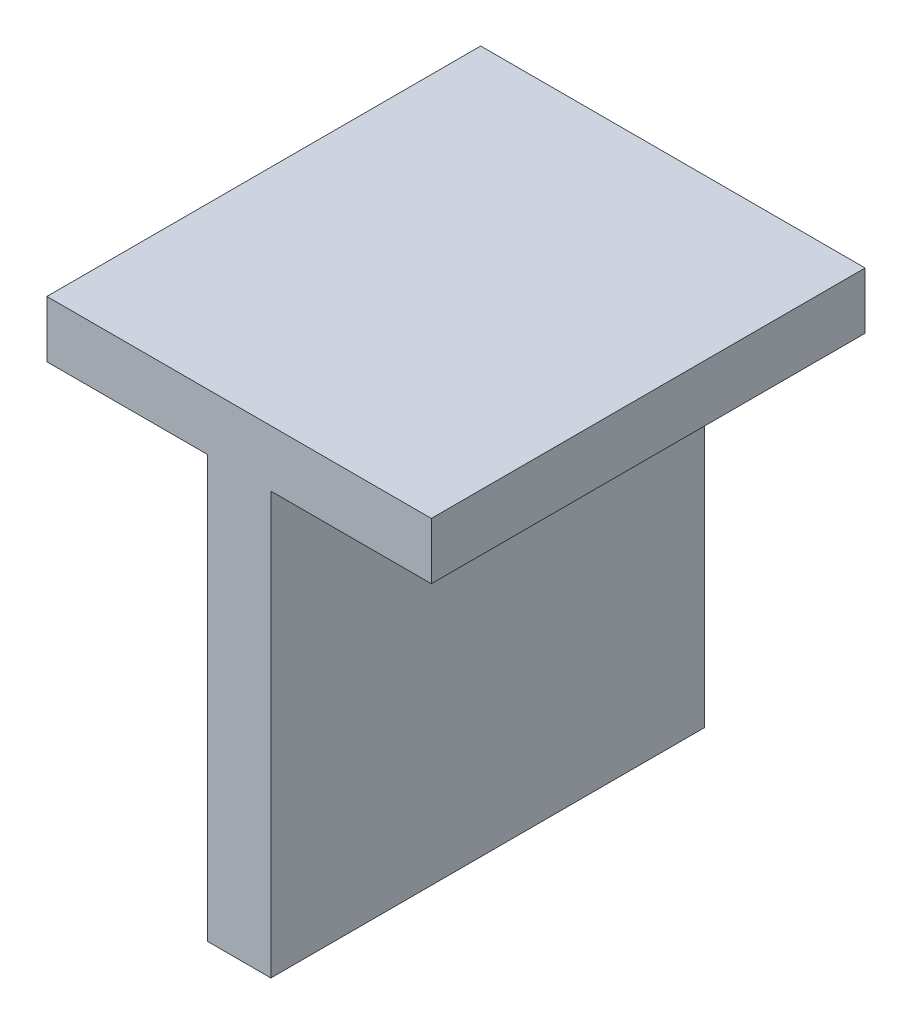
ISO-10303-21;
HEADER;
FILE_DESCRIPTION(('STEP AP214'),'2;1');
FILE_NAME('part.step','',(''),(''),'','','');
FILE_SCHEMA(('AUTOMOTIVE_DESIGN { 1 0 10303 214 1 1 1 1 }'));
ENDSEC;
DATA;
#1=APPLICATION_CONTEXT('core data for automotive mechanical design processes');
#2=APPLICATION_PROTOCOL_DEFINITION('international standard','automotive_design',2000,#1);
#3=PRODUCT_CONTEXT('',#1,'mechanical');
#4=PRODUCT('Part','Part','',(#3));
#5=PRODUCT_RELATED_PRODUCT_CATEGORY('part','',(#4));
#6=PRODUCT_DEFINITION_FORMATION('','',#4);
#7=PRODUCT_DEFINITION_CONTEXT('part definition',#1,'design');
#8=PRODUCT_DEFINITION('design','',#6,#7);
#9=PRODUCT_DEFINITION_SHAPE('','',#8);
#10=(LENGTH_UNIT() NAMED_UNIT(*) SI_UNIT(.MILLI.,.METRE.));
#11=(NAMED_UNIT(*) PLANE_ANGLE_UNIT() SI_UNIT($,.RADIAN.));
#12=(NAMED_UNIT(*) SI_UNIT($,.STERADIAN.) SOLID_ANGLE_UNIT());
#13=UNCERTAINTY_MEASURE_WITH_UNIT(LENGTH_MEASURE(1.E-05),#10,'distance_accuracy_value','');
#14=(GEOMETRIC_REPRESENTATION_CONTEXT(3) GLOBAL_UNCERTAINTY_ASSIGNED_CONTEXT((#13)) GLOBAL_UNIT_ASSIGNED_CONTEXT((#10,
#11,#12)) REPRESENTATION_CONTEXT('',''));
#15=CARTESIAN_POINT('',(0.,0.,0.));
#16=DIRECTION('',(0.,0.,1.));
#17=DIRECTION('',(1.,0.,0.));
#18=AXIS2_PLACEMENT_3D('',#15,#16,#17);
#19=CARTESIAN_POINT('',(-0.729443457161896,-0.704324120785311,0.));
#20=DIRECTION('',(0.,-1.,0.));
#21=DIRECTION('',(1.,0.,0.));
#22=AXIS2_PLACEMENT_3D('',#19,#20,#21);
#23=PLANE('',#22);
#24=DIRECTION('',(-1.,0.,0.));
#25=VECTOR('',#24,1.);
#26=CARTESIAN_POINT('',(-0.692455206347265,-0.704324120785311,0.));
#27=LINE('',#26,#25);
#28=CARTESIAN_POINT('',(-0.692455206347265,-0.704324120785311,0.));
#29=VERTEX_POINT('',#28);
#30=CARTESIAN_POINT('',(-0.729443457161896,-0.704324120785311,0.));
#31=VERTEX_POINT('',#30);
#32=EDGE_CURVE('E11',#29,#31,#27,.T.);
#33=ORIENTED_EDGE('',*,*,#32,.F.);
#34=DIRECTION('',(0.,0.,1.));
#35=VECTOR('',#34,1.);
#36=CARTESIAN_POINT('',(-0.692455206347265,-0.704324120785311,0.));
#37=LINE('',#36,#35);
#38=CARTESIAN_POINT('',(-0.692455206347265,-0.704324120785311,0.1));
#39=VERTEX_POINT('',#38);
#40=EDGE_CURVE('E145',#29,#39,#37,.T.);
#41=ORIENTED_EDGE('',*,*,#40,.T.);
#42=DIRECTION('',(1.,0.,0.));
#43=VECTOR('',#42,1.);
#44=CARTESIAN_POINT('',(-0.729443457161896,-0.704324120785311,0.1));
#45=LINE('',#44,#43);
#46=CARTESIAN_POINT('',(-0.729443457161896,-0.704324120785311,0.1));
#47=VERTEX_POINT('',#46);
#48=EDGE_CURVE('E103',#47,#39,#45,.T.);
#49=ORIENTED_EDGE('',*,*,#48,.F.);
#50=DIRECTION('',(0.,0.,1.));
#51=VECTOR('',#50,1.);
#52=CARTESIAN_POINT('',(-0.729443457161896,-0.704324120785311,0.));
#53=LINE('',#52,#51);
#54=EDGE_CURVE('E140',#31,#47,#53,.T.);
#55=ORIENTED_EDGE('',*,*,#54,.F.);
#56=EDGE_LOOP('',(#33,#41,#49,#55));
#57=FACE_BOUND('',#56,.T.);
#58=ADVANCED_FACE('F17',(#57),#23,.T.);
#59=CARTESIAN_POINT('',(-0.729443457161896,-0.691279955039089,0.));
#60=DIRECTION('',(-1.,0.,0.));
#61=DIRECTION('',(0.,-1.,0.));
#62=AXIS2_PLACEMENT_3D('',#59,#60,#61);
#63=PLANE('',#62);
#64=DIRECTION('',(0.,1.,0.));
#65=VECTOR('',#64,1.);
#66=CARTESIAN_POINT('',(-0.729443457161896,-0.704324120785311,0.));
#67=LINE('',#66,#65);
#68=CARTESIAN_POINT('',(-0.729443457161896,-0.691279955039089,0.));
#69=VERTEX_POINT('',#68);
#70=EDGE_CURVE('E24',#31,#69,#67,.T.);
#71=ORIENTED_EDGE('',*,*,#70,.F.);
#72=ORIENTED_EDGE('',*,*,#54,.T.);
#73=DIRECTION('',(0.,-1.,0.));
#74=VECTOR('',#73,1.);
#75=CARTESIAN_POINT('',(-0.729443457161896,-0.691279955039089,0.1));
#76=LINE('',#75,#74);
#77=CARTESIAN_POINT('',(-0.729443457161896,-0.691279955039089,0.1));
#78=VERTEX_POINT('',#77);
#79=EDGE_CURVE('E132',#78,#47,#76,.T.);
#80=ORIENTED_EDGE('',*,*,#79,.F.);
#81=DIRECTION('',(0.,0.,1.));
#82=VECTOR('',#81,1.);
#83=CARTESIAN_POINT('',(-0.729443457161896,-0.691279955039089,0.));
#84=LINE('',#83,#82);
#85=EDGE_CURVE('E134',#69,#78,#84,.T.);
#86=ORIENTED_EDGE('',*,*,#85,.F.);
#87=EDGE_LOOP('',(#71,#72,#80,#86));
#88=FACE_BOUND('',#87,.T.);
#89=ADVANCED_FACE('F150',(#88),#63,.T.);
#90=CARTESIAN_POINT('',(-0.640814604968383,-0.691279955039089,0.));
#91=DIRECTION('',(0.,1.,0.));
#92=DIRECTION('',(-1.,0.,0.));
#93=AXIS2_PLACEMENT_3D('',#90,#91,#92);
#94=PLANE('',#93);
#95=DIRECTION('',(1.,0.,0.));
#96=VECTOR('',#95,1.);
#97=CARTESIAN_POINT('',(-0.729443457161896,-0.691279955039089,0.));
#98=LINE('',#97,#96);
#99=CARTESIAN_POINT('',(-0.640814604968383,-0.691279955039089,0.));
#100=VERTEX_POINT('',#99);
#101=EDGE_CURVE('E142',#69,#100,#98,.T.);
#102=ORIENTED_EDGE('',*,*,#101,.F.);
#103=ORIENTED_EDGE('',*,*,#85,.T.);
#104=DIRECTION('',(-1.,0.,0.));
#105=VECTOR('',#104,1.);
#106=CARTESIAN_POINT('',(-0.640814604968383,-0.691279955039089,0.1));
#107=LINE('',#106,#105);
#108=CARTESIAN_POINT('',(-0.640814604968383,-0.691279955039089,0.1));
#109=VERTEX_POINT('',#108);
#110=EDGE_CURVE('E124',#109,#78,#107,.T.);
#111=ORIENTED_EDGE('',*,*,#110,.F.);
#112=DIRECTION('',(0.,0.,1.));
#113=VECTOR('',#112,1.);
#114=CARTESIAN_POINT('',(-0.640814604968383,-0.691279955039089,0.));
#115=LINE('',#114,#113);
#116=EDGE_CURVE('E127',#100,#109,#115,.T.);
#117=ORIENTED_EDGE('',*,*,#116,.F.);
#118=EDGE_LOOP('',(#102,#103,#111,#117));
#119=FACE_BOUND('',#118,.T.);
#120=ADVANCED_FACE('F152',(#119),#94,.T.);
#121=CARTESIAN_POINT('',(-0.640814604968383,-0.704324120785311,0.));
#122=DIRECTION('',(1.,0.,0.));
#123=DIRECTION('',(0.,1.,0.));
#124=AXIS2_PLACEMENT_3D('',#121,#122,#123);
#125=PLANE('',#124);
#126=DIRECTION('',(0.,-1.,0.));
#127=VECTOR('',#126,1.);
#128=CARTESIAN_POINT('',(-0.640814604968383,-0.691279955039089,0.));
#129=LINE('',#128,#127);
#130=CARTESIAN_POINT('',(-0.640814604968383,-0.704324120785311,0.));
#131=VERTEX_POINT('',#130);
#132=EDGE_CURVE('E136',#100,#131,#129,.T.);
#133=ORIENTED_EDGE('',*,*,#132,.F.);
#134=ORIENTED_EDGE('',*,*,#116,.T.);
#135=DIRECTION('',(0.,1.,0.));
#136=VECTOR('',#135,1.);
#137=CARTESIAN_POINT('',(-0.640814604968383,-0.704324120785311,0.1));
#138=LINE('',#137,#136);
#139=CARTESIAN_POINT('',(-0.640814604968383,-0.704324120785311,0.1));
#140=VERTEX_POINT('',#139);
#141=EDGE_CURVE('E116',#140,#109,#138,.T.);
#142=ORIENTED_EDGE('',*,*,#141,.F.);
#143=DIRECTION('',(0.,0.,1.));
#144=VECTOR('',#143,1.);
#145=CARTESIAN_POINT('',(-0.640814604968383,-0.704324120785311,0.));
#146=LINE('',#145,#144);
#147=EDGE_CURVE('E119',#131,#140,#146,.T.);
#148=ORIENTED_EDGE('',*,*,#147,.F.);
#149=EDGE_LOOP('',(#133,#134,#142,#148));
#150=FACE_BOUND('',#149,.T.);
#151=ADVANCED_FACE('F156',(#150),#125,.T.);
#152=CARTESIAN_POINT('',(-0.677802855783014,-0.704324120785311,0.));
#153=DIRECTION('',(0.,-1.,0.));
#154=DIRECTION('',(1.,0.,0.));
#155=AXIS2_PLACEMENT_3D('',#152,#153,#154);
#156=PLANE('',#155);
#157=DIRECTION('',(-1.,0.,0.));
#158=VECTOR('',#157,1.);
#159=CARTESIAN_POINT('',(-0.640814604968383,-0.704324120785311,0.));
#160=LINE('',#159,#158);
#161=CARTESIAN_POINT('',(-0.677802855783014,-0.704324120785311,0.));
#162=VERTEX_POINT('',#161);
#163=EDGE_CURVE('E129',#131,#162,#160,.T.);
#164=ORIENTED_EDGE('',*,*,#163,.F.);
#165=ORIENTED_EDGE('',*,*,#147,.T.);
#166=DIRECTION('',(1.,0.,0.));
#167=VECTOR('',#166,1.);
#168=CARTESIAN_POINT('',(-0.677802855783014,-0.704324120785311,0.1));
#169=LINE('',#168,#167);
#170=CARTESIAN_POINT('',(-0.677802855783014,-0.704324120785311,0.1));
#171=VERTEX_POINT('',#170);
#172=EDGE_CURVE('E109',#171,#140,#169,.T.);
#173=ORIENTED_EDGE('',*,*,#172,.F.);
#174=DIRECTION('',(0.,0.,1.));
#175=VECTOR('',#174,1.);
#176=CARTESIAN_POINT('',(-0.677802855783014,-0.704324120785311,0.));
#177=LINE('',#176,#175);
#178=EDGE_CURVE('E112',#162,#171,#177,.T.);
#179=ORIENTED_EDGE('',*,*,#178,.F.);
#180=EDGE_LOOP('',(#164,#165,#173,#179));
#181=FACE_BOUND('',#180,.T.);
#182=ADVANCED_FACE('F160',(#181),#156,.T.);
#183=CARTESIAN_POINT('',(-0.677802855783014,-0.801529958674972,0.));
#184=DIRECTION('',(1.,0.,0.));
#185=DIRECTION('',(0.,1.,0.));
#186=AXIS2_PLACEMENT_3D('',#183,#184,#185);
#187=PLANE('',#186);
#188=DIRECTION('',(0.,-1.,0.));
#189=VECTOR('',#188,1.);
#190=CARTESIAN_POINT('',(-0.677802855783014,-0.704324120785311,0.));
#191=LINE('',#190,#189);
#192=CARTESIAN_POINT('',(-0.677802855783014,-0.801529958674972,0.));
#193=VERTEX_POINT('',#192);
#194=EDGE_CURVE('E121',#162,#193,#191,.T.);
#195=ORIENTED_EDGE('',*,*,#194,.F.);
#196=ORIENTED_EDGE('',*,*,#178,.T.);
#197=DIRECTION('',(0.,1.,0.));
#198=VECTOR('',#197,1.);
#199=CARTESIAN_POINT('',(-0.677802855783014,-0.801529958674972,0.1));
#200=LINE('',#199,#198);
#201=CARTESIAN_POINT('',(-0.677802855783014,-0.801529958674972,0.1));
#202=VERTEX_POINT('',#201);
#203=EDGE_CURVE('E89',#202,#171,#200,.T.);
#204=ORIENTED_EDGE('',*,*,#203,.F.);
#205=DIRECTION('',(0.,0.,1.));
#206=VECTOR('',#205,1.);
#207=CARTESIAN_POINT('',(-0.677802855783014,-0.801529958674972,0.));
#208=LINE('',#207,#206);
#209=EDGE_CURVE('E95',#193,#202,#208,.T.);
#210=ORIENTED_EDGE('',*,*,#209,.F.);
#211=EDGE_LOOP('',(#195,#196,#204,#210));
#212=FACE_BOUND('',#211,.T.);
#213=ADVANCED_FACE('F163',(#212),#187,.T.);
#214=CARTESIAN_POINT('',(-0.692455206347265,-0.801529958674972,0.));
#215=DIRECTION('',(0.,-1.,0.));
#216=DIRECTION('',(1.,0.,0.));
#217=AXIS2_PLACEMENT_3D('',#214,#215,#216);
#218=PLANE('',#217);
#219=DIRECTION('',(-1.,0.,0.));
#220=VECTOR('',#219,1.);
#221=CARTESIAN_POINT('',(-0.677802855783014,-0.801529958674972,0.));
#222=LINE('',#221,#220);
#223=CARTESIAN_POINT('',(-0.692455206347265,-0.801529958674972,0.));
#224=VERTEX_POINT('',#223);
#225=EDGE_CURVE('E114',#193,#224,#222,.T.);
#226=ORIENTED_EDGE('',*,*,#225,.F.);
#227=ORIENTED_EDGE('',*,*,#209,.T.);
#228=DIRECTION('',(1.,0.,0.));
#229=VECTOR('',#228,1.);
#230=CARTESIAN_POINT('',(-0.692455206347265,-0.801529958674972,0.1));
#231=LINE('',#230,#229);
#232=CARTESIAN_POINT('',(-0.692455206347265,-0.801529958674972,0.1));
#233=VERTEX_POINT('',#232);
#234=EDGE_CURVE('E90',#233,#202,#231,.T.);
#235=ORIENTED_EDGE('',*,*,#234,.F.);
#236=DIRECTION('',(0.,0.,1.));
#237=VECTOR('',#236,1.);
#238=CARTESIAN_POINT('',(-0.692455206347265,-0.801529958674972,0.));
#239=LINE('',#238,#237);
#240=EDGE_CURVE('E79',#224,#233,#239,.T.);
#241=ORIENTED_EDGE('',*,*,#240,.F.);
#242=EDGE_LOOP('',(#226,#227,#235,#241));
#243=FACE_BOUND('',#242,.T.);
#244=ADVANCED_FACE('F93',(#243),#218,.T.);
#245=CARTESIAN_POINT('',(-0.692455206347265,-0.704324120785311,0.));
#246=DIRECTION('',(-1.,0.,0.));
#247=DIRECTION('',(0.,-1.,0.));
#248=AXIS2_PLACEMENT_3D('',#245,#246,#247);
#249=PLANE('',#248);
#250=DIRECTION('',(0.,1.,0.));
#251=VECTOR('',#250,1.);
#252=CARTESIAN_POINT('',(-0.692455206347265,-0.801529958674972,0.));
#253=LINE('',#252,#251);
#254=EDGE_CURVE('E86',#224,#29,#253,.T.);
#255=ORIENTED_EDGE('',*,*,#254,.F.);
#256=ORIENTED_EDGE('',*,*,#240,.T.);
#257=DIRECTION('',(0.,-1.,0.));
#258=VECTOR('',#257,1.);
#259=CARTESIAN_POINT('',(-0.692455206347265,-0.704324120785311,0.1));
#260=LINE('',#259,#258);
#261=EDGE_CURVE('E84',#39,#233,#260,.T.);
#262=ORIENTED_EDGE('',*,*,#261,.F.);
#263=ORIENTED_EDGE('',*,*,#40,.F.);
#264=EDGE_LOOP('',(#255,#256,#262,#263));
#265=FACE_BOUND('',#264,.T.);
#266=ADVANCED_FACE('F81',(#265),#249,.T.);
#267=CARTESIAN_POINT('',(-0.685129031065139,-0.728326243071622,0.));
#268=DIRECTION('',(0.,0.,1.));
#269=DIRECTION('',(1.,0.,0.));
#270=AXIS2_PLACEMENT_3D('',#267,#268,#269);
#271=PLANE('',#270);
#272=ORIENTED_EDGE('',*,*,#254,.T.);
#273=ORIENTED_EDGE('',*,*,#32,.T.);
#274=ORIENTED_EDGE('',*,*,#70,.T.);
#275=ORIENTED_EDGE('',*,*,#101,.T.);
#276=ORIENTED_EDGE('',*,*,#132,.T.);
#277=ORIENTED_EDGE('',*,*,#163,.T.);
#278=ORIENTED_EDGE('',*,*,#194,.T.);
#279=ORIENTED_EDGE('',*,*,#225,.T.);
#280=EDGE_LOOP('',(#272,#273,#274,#275,#276,#277,#278,#279));
#281=FACE_BOUND('',#280,.T.);
#282=ADVANCED_FACE('F147',(#281),#271,.F.);
#283=CARTESIAN_POINT('',(-0.685129031065139,-0.728326243071622,0.1));
#284=DIRECTION('',(0.,0.,1.));
#285=DIRECTION('',(1.,0.,0.));
#286=AXIS2_PLACEMENT_3D('',#283,#284,#285);
#287=PLANE('',#286);
#288=ORIENTED_EDGE('',*,*,#261,.T.);
#289=ORIENTED_EDGE('',*,*,#234,.T.);
#290=ORIENTED_EDGE('',*,*,#203,.T.);
#291=ORIENTED_EDGE('',*,*,#172,.T.);
#292=ORIENTED_EDGE('',*,*,#141,.T.);
#293=ORIENTED_EDGE('',*,*,#110,.T.);
#294=ORIENTED_EDGE('',*,*,#79,.T.);
#295=ORIENTED_EDGE('',*,*,#48,.T.);
#296=EDGE_LOOP('',(#288,#289,#290,#291,#292,#293,#294,#295));
#297=FACE_BOUND('',#296,.T.);
#298=ADVANCED_FACE('F100',(#297),#287,.T.);
#299=CLOSED_SHELL('',(#58,#89,#120,#151,#182,#213,#244,#266,#282,#298));
#300=MANIFOLD_SOLID_BREP('B1',#299);
#301=ADVANCED_BREP_SHAPE_REPRESENTATION('',(#18,#300),#14);
#302=SHAPE_DEFINITION_REPRESENTATION(#9,#301);
ENDSEC;
END-ISO-10303-21;
